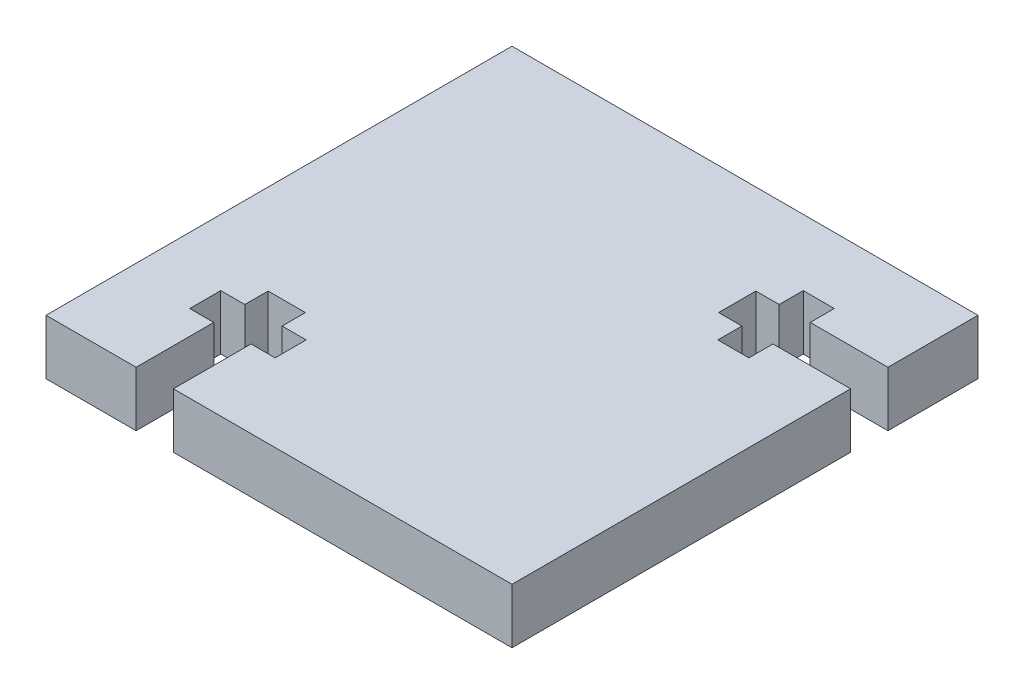
ISO-10303-21;
HEADER;
FILE_DESCRIPTION(('STEP AP214'),'2;1');
FILE_NAME('part.step','',(''),(''),'','','');
FILE_SCHEMA(('AUTOMOTIVE_DESIGN { 1 0 10303 214 1 1 1 1 }'));
ENDSEC;
DATA;
#1=APPLICATION_CONTEXT('core data for automotive mechanical design processes');
#2=APPLICATION_PROTOCOL_DEFINITION('international standard','automotive_design',2000,#1);
#3=PRODUCT_CONTEXT('',#1,'mechanical');
#4=PRODUCT('Part','Part','',(#3));
#5=PRODUCT_RELATED_PRODUCT_CATEGORY('part','',(#4));
#6=PRODUCT_DEFINITION_FORMATION('','',#4);
#7=PRODUCT_DEFINITION_CONTEXT('part definition',#1,'design');
#8=PRODUCT_DEFINITION('design','',#6,#7);
#9=PRODUCT_DEFINITION_SHAPE('','',#8);
#10=(LENGTH_UNIT() NAMED_UNIT(*) SI_UNIT(.MILLI.,.METRE.));
#11=(NAMED_UNIT(*) PLANE_ANGLE_UNIT() SI_UNIT($,.RADIAN.));
#12=(NAMED_UNIT(*) SI_UNIT($,.STERADIAN.) SOLID_ANGLE_UNIT());
#13=UNCERTAINTY_MEASURE_WITH_UNIT(LENGTH_MEASURE(1.E-05),#10,'distance_accuracy_value','');
#14=(GEOMETRIC_REPRESENTATION_CONTEXT(3) GLOBAL_UNCERTAINTY_ASSIGNED_CONTEXT((#13)) GLOBAL_UNIT_ASSIGNED_CONTEXT((#10,
#11,#12)) REPRESENTATION_CONTEXT('',''));
#15=CARTESIAN_POINT('',(0.,0.,0.));
#16=DIRECTION('',(0.,0.,1.));
#17=DIRECTION('',(1.,0.,0.));
#18=AXIS2_PLACEMENT_3D('',#15,#16,#17);
#19=CARTESIAN_POINT('',(-38.1,4.4958,-38.1));
#20=DIRECTION('',(1.,0.,0.));
#21=DIRECTION('',(0.,0.,-1.));
#22=AXIS2_PLACEMENT_3D('',#19,#20,#21);
#23=PLANE('',#22);
#24=DIRECTION('',(0.,0.,1.));
#25=VECTOR('',#24,1.);
#26=CARTESIAN_POINT('',(-38.1,0.,-38.1));
#27=LINE('',#26,#25);
#28=CARTESIAN_POINT('',(-38.1,0.,-38.1));
#29=VERTEX_POINT('',#28);
#30=CARTESIAN_POINT('',(-38.1,0.,0.));
#31=VERTEX_POINT('',#30);
#32=EDGE_CURVE('E251',#29,#31,#27,.T.);
#33=ORIENTED_EDGE('',*,*,#32,.T.);
#34=DIRECTION('',(0.,-1.,0.));
#35=VECTOR('',#34,1.);
#36=CARTESIAN_POINT('',(-38.1,4.4958,0.));
#37=LINE('',#36,#35);
#38=CARTESIAN_POINT('',(-38.1,4.4958,0.));
#39=VERTEX_POINT('',#38);
#40=EDGE_CURVE('E11',#39,#31,#37,.T.);
#41=ORIENTED_EDGE('',*,*,#40,.F.);
#42=DIRECTION('',(0.,0.,1.));
#43=VECTOR('',#42,1.);
#44=CARTESIAN_POINT('',(-38.1,4.4958,-38.1));
#45=LINE('',#44,#43);
#46=CARTESIAN_POINT('',(-38.1,4.4958,-38.1));
#47=VERTEX_POINT('',#46);
#48=EDGE_CURVE('E305',#47,#39,#45,.T.);
#49=ORIENTED_EDGE('',*,*,#48,.F.);
#50=DIRECTION('',(0.,-1.,0.));
#51=VECTOR('',#50,1.);
#52=CARTESIAN_POINT('',(-38.1,4.4958,-38.1));
#53=LINE('',#52,#51);
#54=EDGE_CURVE('E247',#47,#29,#53,.T.);
#55=ORIENTED_EDGE('',*,*,#54,.T.);
#56=EDGE_LOOP('',(#33,#41,#49,#55));
#57=FACE_BOUND('',#56,.T.);
#58=ADVANCED_FACE('F35',(#57),#23,.F.);
#59=CARTESIAN_POINT('',(-38.1,4.4958,0.));
#60=DIRECTION('',(0.,0.,-1.));
#61=DIRECTION('',(-1.,0.,0.));
#62=AXIS2_PLACEMENT_3D('',#59,#60,#61);
#63=PLANE('',#62);
#64=DIRECTION('',(1.,0.,0.));
#65=VECTOR('',#64,1.);
#66=CARTESIAN_POINT('',(-38.1,0.,0.));
#67=LINE('',#66,#65);
#68=CARTESIAN_POINT('',(-30.734,0.,0.));
#69=VERTEX_POINT('',#68);
#70=EDGE_CURVE('E254',#31,#69,#67,.T.);
#71=ORIENTED_EDGE('',*,*,#70,.T.);
#72=DIRECTION('',(0.,-1.,0.));
#73=VECTOR('',#72,1.);
#74=CARTESIAN_POINT('',(-30.734,4.4958,0.));
#75=LINE('',#74,#73);
#76=CARTESIAN_POINT('',(-30.734,4.4958,0.));
#77=VERTEX_POINT('',#76);
#78=EDGE_CURVE('E43',#77,#69,#75,.T.);
#79=ORIENTED_EDGE('',*,*,#78,.F.);
#80=DIRECTION('',(1.,0.,0.));
#81=VECTOR('',#80,1.);
#82=CARTESIAN_POINT('',(-38.1,4.4958,0.));
#83=LINE('',#82,#81);
#84=EDGE_CURVE('E154',#39,#77,#83,.T.);
#85=ORIENTED_EDGE('',*,*,#84,.F.);
#86=ORIENTED_EDGE('',*,*,#40,.T.);
#87=EDGE_LOOP('',(#71,#79,#85,#86));
#88=FACE_BOUND('',#87,.T.);
#89=ADVANCED_FACE('F463',(#88),#63,.F.);
#90=CARTESIAN_POINT('',(-30.734,4.4958,0.));
#91=DIRECTION('',(-1.,0.,0.));
#92=DIRECTION('',(0.,0.,1.));
#93=AXIS2_PLACEMENT_3D('',#90,#91,#92);
#94=PLANE('',#93);
#95=DIRECTION('',(0.,0.,-1.));
#96=VECTOR('',#95,1.);
#97=CARTESIAN_POINT('',(-30.734,0.,0.));
#98=LINE('',#97,#96);
#99=CARTESIAN_POINT('',(-30.734,0.,-6.35));
#100=VERTEX_POINT('',#99);
#101=EDGE_CURVE('E256',#69,#100,#98,.T.);
#102=ORIENTED_EDGE('',*,*,#101,.T.);
#103=DIRECTION('',(0.,-1.,0.));
#104=VECTOR('',#103,1.);
#105=CARTESIAN_POINT('',(-30.734,4.4958,-6.35));
#106=LINE('',#105,#104);
#107=CARTESIAN_POINT('',(-30.734,4.4958,-6.35));
#108=VERTEX_POINT('',#107);
#109=EDGE_CURVE('E372',#108,#100,#106,.T.);
#110=ORIENTED_EDGE('',*,*,#109,.F.);
#111=DIRECTION('',(0.,0.,-1.));
#112=VECTOR('',#111,1.);
#113=CARTESIAN_POINT('',(-30.734,4.4958,0.));
#114=LINE('',#113,#112);
#115=EDGE_CURVE('E380',#77,#108,#114,.T.);
#116=ORIENTED_EDGE('',*,*,#115,.F.);
#117=ORIENTED_EDGE('',*,*,#78,.T.);
#118=EDGE_LOOP('',(#102,#110,#116,#117));
#119=FACE_BOUND('',#118,.T.);
#120=ADVANCED_FACE('F378',(#119),#94,.F.);
#121=CARTESIAN_POINT('',(-30.734,4.4958,-6.35));
#122=DIRECTION('',(0.,0.,1.));
#123=DIRECTION('',(1.,0.,0.));
#124=AXIS2_PLACEMENT_3D('',#121,#122,#123);
#125=PLANE('',#124);
#126=DIRECTION('',(-1.,0.,0.));
#127=VECTOR('',#126,1.);
#128=CARTESIAN_POINT('',(-30.734,0.,-6.35));
#129=LINE('',#128,#127);
#130=CARTESIAN_POINT('',(-32.7025,0.,-6.35));
#131=VERTEX_POINT('',#130);
#132=EDGE_CURVE('E258',#100,#131,#129,.T.);
#133=ORIENTED_EDGE('',*,*,#132,.T.);
#134=DIRECTION('',(0.,-1.,0.));
#135=VECTOR('',#134,1.);
#136=CARTESIAN_POINT('',(-32.7025,4.4958,-6.35));
#137=LINE('',#136,#135);
#138=CARTESIAN_POINT('',(-32.7025,4.4958,-6.35));
#139=VERTEX_POINT('',#138);
#140=EDGE_CURVE('E369',#139,#131,#137,.T.);
#141=ORIENTED_EDGE('',*,*,#140,.F.);
#142=DIRECTION('',(-1.,0.,0.));
#143=VECTOR('',#142,1.);
#144=CARTESIAN_POINT('',(-30.734,4.4958,-6.35));
#145=LINE('',#144,#143);
#146=EDGE_CURVE('E398',#108,#139,#145,.T.);
#147=ORIENTED_EDGE('',*,*,#146,.F.);
#148=ORIENTED_EDGE('',*,*,#109,.T.);
#149=EDGE_LOOP('',(#133,#141,#147,#148));
#150=FACE_BOUND('',#149,.T.);
#151=ADVANCED_FACE('F389',(#150),#125,.F.);
#152=CARTESIAN_POINT('',(-32.7025,4.4958,-6.35));
#153=DIRECTION('',(-1.,0.,0.));
#154=DIRECTION('',(0.,0.,1.));
#155=AXIS2_PLACEMENT_3D('',#152,#153,#154);
#156=PLANE('',#155);
#157=DIRECTION('',(0.,0.,-1.));
#158=VECTOR('',#157,1.);
#159=CARTESIAN_POINT('',(-32.7025,0.,-6.35));
#160=LINE('',#159,#158);
#161=CARTESIAN_POINT('',(-32.7025,0.,-8.89));
#162=VERTEX_POINT('',#161);
#163=EDGE_CURVE('E260',#131,#162,#160,.T.);
#164=ORIENTED_EDGE('',*,*,#163,.T.);
#165=DIRECTION('',(0.,-1.,0.));
#166=VECTOR('',#165,1.);
#167=CARTESIAN_POINT('',(-32.7025,4.4958,-8.89));
#168=LINE('',#167,#166);
#169=CARTESIAN_POINT('',(-32.7025,4.4958,-8.89));
#170=VERTEX_POINT('',#169);
#171=EDGE_CURVE('E366',#170,#162,#168,.T.);
#172=ORIENTED_EDGE('',*,*,#171,.F.);
#173=DIRECTION('',(0.,0.,-1.));
#174=VECTOR('',#173,1.);
#175=CARTESIAN_POINT('',(-32.7025,4.4958,-6.35));
#176=LINE('',#175,#174);
#177=EDGE_CURVE('E395',#139,#170,#176,.T.);
#178=ORIENTED_EDGE('',*,*,#177,.F.);
#179=ORIENTED_EDGE('',*,*,#140,.T.);
#180=EDGE_LOOP('',(#164,#172,#178,#179));
#181=FACE_BOUND('',#180,.T.);
#182=ADVANCED_FACE('F393',(#181),#156,.F.);
#183=CARTESIAN_POINT('',(-32.7025,4.4958,-8.89));
#184=DIRECTION('',(0.,0.,-1.));
#185=DIRECTION('',(-1.,0.,0.));
#186=AXIS2_PLACEMENT_3D('',#183,#184,#185);
#187=PLANE('',#186);
#188=DIRECTION('',(1.,0.,0.));
#189=VECTOR('',#188,1.);
#190=CARTESIAN_POINT('',(-32.7025,0.,-8.89));
#191=LINE('',#190,#189);
#192=CARTESIAN_POINT('',(-30.734,0.,-8.89));
#193=VERTEX_POINT('',#192);
#194=EDGE_CURVE('E262',#162,#193,#191,.T.);
#195=ORIENTED_EDGE('',*,*,#194,.T.);
#196=DIRECTION('',(0.,-1.,0.));
#197=VECTOR('',#196,1.);
#198=CARTESIAN_POINT('',(-30.734,4.4958,-8.89));
#199=LINE('',#198,#197);
#200=CARTESIAN_POINT('',(-30.734,4.4958,-8.89));
#201=VERTEX_POINT('',#200);
#202=EDGE_CURVE('E363',#201,#193,#199,.T.);
#203=ORIENTED_EDGE('',*,*,#202,.F.);
#204=DIRECTION('',(1.,0.,0.));
#205=VECTOR('',#204,1.);
#206=CARTESIAN_POINT('',(-32.7025,4.4958,-8.89));
#207=LINE('',#206,#205);
#208=EDGE_CURVE('E397',#170,#201,#207,.T.);
#209=ORIENTED_EDGE('',*,*,#208,.F.);
#210=ORIENTED_EDGE('',*,*,#171,.T.);
#211=EDGE_LOOP('',(#195,#203,#209,#210));
#212=FACE_BOUND('',#211,.T.);
#213=ADVANCED_FACE('F476',(#212),#187,.F.);
#214=CARTESIAN_POINT('',(-30.734,4.4958,-8.89));
#215=DIRECTION('',(-1.,0.,0.));
#216=DIRECTION('',(0.,0.,1.));
#217=AXIS2_PLACEMENT_3D('',#214,#215,#216);
#218=PLANE('',#217);
#219=DIRECTION('',(0.,0.,-1.));
#220=VECTOR('',#219,1.);
#221=CARTESIAN_POINT('',(-30.734,0.,-8.89));
#222=LINE('',#221,#220);
#223=CARTESIAN_POINT('',(-30.734,0.,-10.795));
#224=VERTEX_POINT('',#223);
#225=EDGE_CURVE('E264',#193,#224,#222,.T.);
#226=ORIENTED_EDGE('',*,*,#225,.T.);
#227=DIRECTION('',(0.,-1.,0.));
#228=VECTOR('',#227,1.);
#229=CARTESIAN_POINT('',(-30.734,4.4958,-10.795));
#230=LINE('',#229,#228);
#231=CARTESIAN_POINT('',(-30.734,4.4958,-10.795));
#232=VERTEX_POINT('',#231);
#233=EDGE_CURVE('E360',#232,#224,#230,.T.);
#234=ORIENTED_EDGE('',*,*,#233,.F.);
#235=DIRECTION('',(0.,0.,-1.));
#236=VECTOR('',#235,1.);
#237=CARTESIAN_POINT('',(-30.734,4.4958,-8.89));
#238=LINE('',#237,#236);
#239=EDGE_CURVE('E400',#201,#232,#238,.T.);
#240=ORIENTED_EDGE('',*,*,#239,.F.);
#241=ORIENTED_EDGE('',*,*,#202,.T.);
#242=EDGE_LOOP('',(#226,#234,#240,#241));
#243=FACE_BOUND('',#242,.T.);
#244=ADVANCED_FACE('F479',(#243),#218,.F.);
#245=CARTESIAN_POINT('',(-30.734,4.4958,-10.795));
#246=DIRECTION('',(0.,0.,-1.));
#247=DIRECTION('',(-1.,0.,0.));
#248=AXIS2_PLACEMENT_3D('',#245,#246,#247);
#249=PLANE('',#248);
#250=DIRECTION('',(1.,0.,0.));
#251=VECTOR('',#250,1.);
#252=CARTESIAN_POINT('',(-30.734,0.,-10.795));
#253=LINE('',#252,#251);
#254=CARTESIAN_POINT('',(-27.686,0.,-10.795));
#255=VERTEX_POINT('',#254);
#256=EDGE_CURVE('E266',#224,#255,#253,.T.);
#257=ORIENTED_EDGE('',*,*,#256,.T.);
#258=DIRECTION('',(0.,-1.,0.));
#259=VECTOR('',#258,1.);
#260=CARTESIAN_POINT('',(-27.686,4.4958,-10.795));
#261=LINE('',#260,#259);
#262=CARTESIAN_POINT('',(-27.686,4.4958,-10.795));
#263=VERTEX_POINT('',#262);
#264=EDGE_CURVE('E357',#263,#255,#261,.T.);
#265=ORIENTED_EDGE('',*,*,#264,.F.);
#266=DIRECTION('',(1.,0.,0.));
#267=VECTOR('',#266,1.);
#268=CARTESIAN_POINT('',(-30.734,4.4958,-10.795));
#269=LINE('',#268,#267);
#270=EDGE_CURVE('E406',#232,#263,#269,.T.);
#271=ORIENTED_EDGE('',*,*,#270,.F.);
#272=ORIENTED_EDGE('',*,*,#233,.T.);
#273=EDGE_LOOP('',(#257,#265,#271,#272));
#274=FACE_BOUND('',#273,.T.);
#275=ADVANCED_FACE('F483',(#274),#249,.F.);
#276=CARTESIAN_POINT('',(-27.686,4.4958,-10.795));
#277=DIRECTION('',(1.,0.,0.));
#278=DIRECTION('',(0.,0.,-1.));
#279=AXIS2_PLACEMENT_3D('',#276,#277,#278);
#280=PLANE('',#279);
#281=DIRECTION('',(0.,0.,1.));
#282=VECTOR('',#281,1.);
#283=CARTESIAN_POINT('',(-27.686,0.,-10.795));
#284=LINE('',#283,#282);
#285=CARTESIAN_POINT('',(-27.686,0.,-8.89));
#286=VERTEX_POINT('',#285);
#287=EDGE_CURVE('E268',#255,#286,#284,.T.);
#288=ORIENTED_EDGE('',*,*,#287,.T.);
#289=DIRECTION('',(0.,-1.,0.));
#290=VECTOR('',#289,1.);
#291=CARTESIAN_POINT('',(-27.686,4.4958,-8.89));
#292=LINE('',#291,#290);
#293=CARTESIAN_POINT('',(-27.686,4.4958,-8.89));
#294=VERTEX_POINT('',#293);
#295=EDGE_CURVE('E354',#294,#286,#292,.T.);
#296=ORIENTED_EDGE('',*,*,#295,.F.);
#297=DIRECTION('',(0.,0.,1.));
#298=VECTOR('',#297,1.);
#299=CARTESIAN_POINT('',(-27.686,4.4958,-10.795));
#300=LINE('',#299,#298);
#301=EDGE_CURVE('E408',#263,#294,#300,.T.);
#302=ORIENTED_EDGE('',*,*,#301,.F.);
#303=ORIENTED_EDGE('',*,*,#264,.T.);
#304=EDGE_LOOP('',(#288,#296,#302,#303));
#305=FACE_BOUND('',#304,.T.);
#306=ADVANCED_FACE('F487',(#305),#280,.F.);
#307=CARTESIAN_POINT('',(-27.686,4.4958,-8.89));
#308=DIRECTION('',(0.,0.,-1.));
#309=DIRECTION('',(-1.,0.,0.));
#310=AXIS2_PLACEMENT_3D('',#307,#308,#309);
#311=PLANE('',#310);
#312=DIRECTION('',(1.,0.,0.));
#313=VECTOR('',#312,1.);
#314=CARTESIAN_POINT('',(-27.686,0.,-8.89));
#315=LINE('',#314,#313);
#316=CARTESIAN_POINT('',(-25.7175,0.,-8.89));
#317=VERTEX_POINT('',#316);
#318=EDGE_CURVE('E270',#286,#317,#315,.T.);
#319=ORIENTED_EDGE('',*,*,#318,.T.);
#320=DIRECTION('',(0.,-1.,0.));
#321=VECTOR('',#320,1.);
#322=CARTESIAN_POINT('',(-25.7175,4.4958,-8.89));
#323=LINE('',#322,#321);
#324=CARTESIAN_POINT('',(-25.7175,4.4958,-8.89));
#325=VERTEX_POINT('',#324);
#326=EDGE_CURVE('E351',#325,#317,#323,.T.);
#327=ORIENTED_EDGE('',*,*,#326,.F.);
#328=DIRECTION('',(1.,0.,0.));
#329=VECTOR('',#328,1.);
#330=CARTESIAN_POINT('',(-27.686,4.4958,-8.89));
#331=LINE('',#330,#329);
#332=EDGE_CURVE('E410',#294,#325,#331,.T.);
#333=ORIENTED_EDGE('',*,*,#332,.F.);
#334=ORIENTED_EDGE('',*,*,#295,.T.);
#335=EDGE_LOOP('',(#319,#327,#333,#334));
#336=FACE_BOUND('',#335,.T.);
#337=ADVANCED_FACE('F491',(#336),#311,.F.);
#338=CARTESIAN_POINT('',(-25.7175,4.4958,-8.89));
#339=DIRECTION('',(1.,0.,0.));
#340=DIRECTION('',(0.,0.,-1.));
#341=AXIS2_PLACEMENT_3D('',#338,#339,#340);
#342=PLANE('',#341);
#343=DIRECTION('',(0.,0.,1.));
#344=VECTOR('',#343,1.);
#345=CARTESIAN_POINT('',(-25.7175,0.,-8.89));
#346=LINE('',#345,#344);
#347=CARTESIAN_POINT('',(-25.7175,0.,-6.35));
#348=VERTEX_POINT('',#347);
#349=EDGE_CURVE('E272',#317,#348,#346,.T.);
#350=ORIENTED_EDGE('',*,*,#349,.T.);
#351=DIRECTION('',(0.,-1.,0.));
#352=VECTOR('',#351,1.);
#353=CARTESIAN_POINT('',(-25.7175,4.4958,-6.35));
#354=LINE('',#353,#352);
#355=CARTESIAN_POINT('',(-25.7175,4.4958,-6.35));
#356=VERTEX_POINT('',#355);
#357=EDGE_CURVE('E348',#356,#348,#354,.T.);
#358=ORIENTED_EDGE('',*,*,#357,.F.);
#359=DIRECTION('',(0.,0.,1.));
#360=VECTOR('',#359,1.);
#361=CARTESIAN_POINT('',(-25.7175,4.4958,-8.89));
#362=LINE('',#361,#360);
#363=EDGE_CURVE('E412',#325,#356,#362,.T.);
#364=ORIENTED_EDGE('',*,*,#363,.F.);
#365=ORIENTED_EDGE('',*,*,#326,.T.);
#366=EDGE_LOOP('',(#350,#358,#364,#365));
#367=FACE_BOUND('',#366,.T.);
#368=ADVANCED_FACE('F495',(#367),#342,.F.);
#369=CARTESIAN_POINT('',(-25.7175,4.4958,-6.35));
#370=DIRECTION('',(0.,0.,1.));
#371=DIRECTION('',(1.,0.,0.));
#372=AXIS2_PLACEMENT_3D('',#369,#370,#371);
#373=PLANE('',#372);
#374=DIRECTION('',(-1.,0.,0.));
#375=VECTOR('',#374,1.);
#376=CARTESIAN_POINT('',(-25.7175,0.,-6.35));
#377=LINE('',#376,#375);
#378=CARTESIAN_POINT('',(-27.686,0.,-6.35));
#379=VERTEX_POINT('',#378);
#380=EDGE_CURVE('E274',#348,#379,#377,.T.);
#381=ORIENTED_EDGE('',*,*,#380,.T.);
#382=DIRECTION('',(0.,-1.,0.));
#383=VECTOR('',#382,1.);
#384=CARTESIAN_POINT('',(-27.686,4.4958,-6.35));
#385=LINE('',#384,#383);
#386=CARTESIAN_POINT('',(-27.686,4.4958,-6.35));
#387=VERTEX_POINT('',#386);
#388=EDGE_CURVE('E345',#387,#379,#385,.T.);
#389=ORIENTED_EDGE('',*,*,#388,.F.);
#390=DIRECTION('',(-1.,0.,0.));
#391=VECTOR('',#390,1.);
#392=CARTESIAN_POINT('',(-25.7175,4.4958,-6.35));
#393=LINE('',#392,#391);
#394=EDGE_CURVE('E414',#356,#387,#393,.T.);
#395=ORIENTED_EDGE('',*,*,#394,.F.);
#396=ORIENTED_EDGE('',*,*,#357,.T.);
#397=EDGE_LOOP('',(#381,#389,#395,#396));
#398=FACE_BOUND('',#397,.T.);
#399=ADVANCED_FACE('F499',(#398),#373,.F.);
#400=CARTESIAN_POINT('',(-27.686,4.4958,-6.35));
#401=DIRECTION('',(1.,0.,0.));
#402=DIRECTION('',(0.,0.,-1.));
#403=AXIS2_PLACEMENT_3D('',#400,#401,#402);
#404=PLANE('',#403);
#405=DIRECTION('',(0.,0.,1.));
#406=VECTOR('',#405,1.);
#407=CARTESIAN_POINT('',(-27.686,0.,-6.35));
#408=LINE('',#407,#406);
#409=CARTESIAN_POINT('',(-27.686,0.,0.));
#410=VERTEX_POINT('',#409);
#411=EDGE_CURVE('E276',#379,#410,#408,.T.);
#412=ORIENTED_EDGE('',*,*,#411,.T.);
#413=DIRECTION('',(0.,-1.,0.));
#414=VECTOR('',#413,1.);
#415=CARTESIAN_POINT('',(-27.686,4.4958,0.));
#416=LINE('',#415,#414);
#417=CARTESIAN_POINT('',(-27.686,4.4958,0.));
#418=VERTEX_POINT('',#417);
#419=EDGE_CURVE('E342',#418,#410,#416,.T.);
#420=ORIENTED_EDGE('',*,*,#419,.F.);
#421=DIRECTION('',(0.,0.,1.));
#422=VECTOR('',#421,1.);
#423=CARTESIAN_POINT('',(-27.686,4.4958,-6.35));
#424=LINE('',#423,#422);
#425=EDGE_CURVE('E416',#387,#418,#424,.T.);
#426=ORIENTED_EDGE('',*,*,#425,.F.);
#427=ORIENTED_EDGE('',*,*,#388,.T.);
#428=EDGE_LOOP('',(#412,#420,#426,#427));
#429=FACE_BOUND('',#428,.T.);
#430=ADVANCED_FACE('F503',(#429),#404,.F.);
#431=CARTESIAN_POINT('',(-27.686,4.4958,0.));
#432=DIRECTION('',(0.,0.,-1.));
#433=DIRECTION('',(-1.,0.,0.));
#434=AXIS2_PLACEMENT_3D('',#431,#432,#433);
#435=PLANE('',#434);
#436=DIRECTION('',(1.,0.,0.));
#437=VECTOR('',#436,1.);
#438=CARTESIAN_POINT('',(-27.686,0.,0.));
#439=LINE('',#438,#437);
#440=CARTESIAN_POINT('',(0.,0.,0.));
#441=VERTEX_POINT('',#440);
#442=EDGE_CURVE('E278',#410,#441,#439,.T.);
#443=ORIENTED_EDGE('',*,*,#442,.T.);
#444=DIRECTION('',(0.,-1.,0.));
#445=VECTOR('',#444,1.);
#446=CARTESIAN_POINT('',(0.,4.4958,0.));
#447=LINE('',#446,#445);
#448=CARTESIAN_POINT('',(0.,4.4958,0.));
#449=VERTEX_POINT('',#448);
#450=EDGE_CURVE('E339',#449,#441,#447,.T.);
#451=ORIENTED_EDGE('',*,*,#450,.F.);
#452=DIRECTION('',(1.,0.,0.));
#453=VECTOR('',#452,1.);
#454=CARTESIAN_POINT('',(-27.686,4.4958,0.));
#455=LINE('',#454,#453);
#456=EDGE_CURVE('E418',#418,#449,#455,.T.);
#457=ORIENTED_EDGE('',*,*,#456,.F.);
#458=ORIENTED_EDGE('',*,*,#419,.T.);
#459=EDGE_LOOP('',(#443,#451,#457,#458));
#460=FACE_BOUND('',#459,.T.);
#461=ADVANCED_FACE('F507',(#460),#435,.F.);
#462=CARTESIAN_POINT('',(0.,4.4958,-27.686));
#463=DIRECTION('',(-1.,0.,0.));
#464=DIRECTION('',(0.,0.,1.));
#465=AXIS2_PLACEMENT_3D('',#462,#463,#464);
#466=PLANE('',#465);
#467=DIRECTION('',(0.,0.,-1.));
#468=VECTOR('',#467,1.);
#469=CARTESIAN_POINT('',(0.,0.,-27.686));
#470=LINE('',#469,#468);
#471=CARTESIAN_POINT('',(0.,0.,-27.686));
#472=VERTEX_POINT('',#471);
#473=EDGE_CURVE('E280',#441,#472,#470,.T.);
#474=ORIENTED_EDGE('',*,*,#473,.T.);
#475=DIRECTION('',(0.,-1.,0.));
#476=VECTOR('',#475,1.);
#477=CARTESIAN_POINT('',(0.,4.4958,-27.686));
#478=LINE('',#477,#476);
#479=CARTESIAN_POINT('',(0.,4.4958,-27.686));
#480=VERTEX_POINT('',#479);
#481=EDGE_CURVE('E336',#480,#472,#478,.T.);
#482=ORIENTED_EDGE('',*,*,#481,.F.);
#483=DIRECTION('',(0.,0.,-1.));
#484=VECTOR('',#483,1.);
#485=CARTESIAN_POINT('',(0.,4.4958,-27.686));
#486=LINE('',#485,#484);
#487=EDGE_CURVE('E420',#449,#480,#486,.T.);
#488=ORIENTED_EDGE('',*,*,#487,.F.);
#489=ORIENTED_EDGE('',*,*,#450,.T.);
#490=EDGE_LOOP('',(#474,#482,#488,#489));
#491=FACE_BOUND('',#490,.T.);
#492=ADVANCED_FACE('F511',(#491),#466,.F.);
#493=CARTESIAN_POINT('',(0.,4.4958,-27.686));
#494=DIRECTION('',(0.,0.,1.));
#495=DIRECTION('',(1.,0.,0.));
#496=AXIS2_PLACEMENT_3D('',#493,#494,#495);
#497=PLANE('',#496);
#498=DIRECTION('',(-1.,0.,0.));
#499=VECTOR('',#498,1.);
#500=CARTESIAN_POINT('',(0.,0.,-27.686));
#501=LINE('',#500,#499);
#502=CARTESIAN_POINT('',(-6.35,0.,-27.686));
#503=VERTEX_POINT('',#502);
#504=EDGE_CURVE('E282',#472,#503,#501,.T.);
#505=ORIENTED_EDGE('',*,*,#504,.T.);
#506=DIRECTION('',(0.,-1.,0.));
#507=VECTOR('',#506,1.);
#508=CARTESIAN_POINT('',(-6.35,4.4958,-27.686));
#509=LINE('',#508,#507);
#510=CARTESIAN_POINT('',(-6.35,4.4958,-27.686));
#511=VERTEX_POINT('',#510);
#512=EDGE_CURVE('E333',#511,#503,#509,.T.);
#513=ORIENTED_EDGE('',*,*,#512,.F.);
#514=DIRECTION('',(-1.,0.,0.));
#515=VECTOR('',#514,1.);
#516=CARTESIAN_POINT('',(0.,4.4958,-27.686));
#517=LINE('',#516,#515);
#518=EDGE_CURVE('E422',#480,#511,#517,.T.);
#519=ORIENTED_EDGE('',*,*,#518,.F.);
#520=ORIENTED_EDGE('',*,*,#481,.T.);
#521=EDGE_LOOP('',(#505,#513,#519,#520));
#522=FACE_BOUND('',#521,.T.);
#523=ADVANCED_FACE('F515',(#522),#497,.F.);
#524=CARTESIAN_POINT('',(-6.35,4.4958,-27.686));
#525=DIRECTION('',(1.,0.,0.));
#526=DIRECTION('',(0.,0.,-1.));
#527=AXIS2_PLACEMENT_3D('',#524,#525,#526);
#528=PLANE('',#527);
#529=DIRECTION('',(0.,0.,1.));
#530=VECTOR('',#529,1.);
#531=CARTESIAN_POINT('',(-6.35,0.,-27.686));
#532=LINE('',#531,#530);
#533=CARTESIAN_POINT('',(-6.35,0.,-25.7175000000001));
#534=VERTEX_POINT('',#533);
#535=EDGE_CURVE('E284',#503,#534,#532,.T.);
#536=ORIENTED_EDGE('',*,*,#535,.T.);
#537=DIRECTION('',(0.,-1.,0.));
#538=VECTOR('',#537,1.);
#539=CARTESIAN_POINT('',(-6.35,4.4958,-25.7175000000001));
#540=LINE('',#539,#538);
#541=CARTESIAN_POINT('',(-6.35,4.4958,-25.7175000000001));
#542=VERTEX_POINT('',#541);
#543=EDGE_CURVE('E330',#542,#534,#540,.T.);
#544=ORIENTED_EDGE('',*,*,#543,.F.);
#545=DIRECTION('',(0.,0.,1.));
#546=VECTOR('',#545,1.);
#547=CARTESIAN_POINT('',(-6.35,4.4958,-27.686));
#548=LINE('',#547,#546);
#549=EDGE_CURVE('E424',#511,#542,#548,.T.);
#550=ORIENTED_EDGE('',*,*,#549,.F.);
#551=ORIENTED_EDGE('',*,*,#512,.T.);
#552=EDGE_LOOP('',(#536,#544,#550,#551));
#553=FACE_BOUND('',#552,.T.);
#554=ADVANCED_FACE('F519',(#553),#528,.F.);
#555=CARTESIAN_POINT('',(-6.35,4.4958,-25.7175000000001));
#556=DIRECTION('',(0.,0.,1.));
#557=DIRECTION('',(1.,0.,0.));
#558=AXIS2_PLACEMENT_3D('',#555,#556,#557);
#559=PLANE('',#558);
#560=DIRECTION('',(-1.,0.,0.));
#561=VECTOR('',#560,1.);
#562=CARTESIAN_POINT('',(-6.35,0.,-25.7175000000001));
#563=LINE('',#562,#561);
#564=CARTESIAN_POINT('',(-8.89,0.,-25.7175000000001));
#565=VERTEX_POINT('',#564);
#566=EDGE_CURVE('E286',#534,#565,#563,.T.);
#567=ORIENTED_EDGE('',*,*,#566,.T.);
#568=DIRECTION('',(0.,-1.,0.));
#569=VECTOR('',#568,1.);
#570=CARTESIAN_POINT('',(-8.89,4.4958,-25.7175000000001));
#571=LINE('',#570,#569);
#572=CARTESIAN_POINT('',(-8.89,4.4958,-25.7175000000001));
#573=VERTEX_POINT('',#572);
#574=EDGE_CURVE('E327',#573,#565,#571,.T.);
#575=ORIENTED_EDGE('',*,*,#574,.F.);
#576=DIRECTION('',(-1.,0.,0.));
#577=VECTOR('',#576,1.);
#578=CARTESIAN_POINT('',(-6.35,4.4958,-25.7175000000001));
#579=LINE('',#578,#577);
#580=EDGE_CURVE('E426',#542,#573,#579,.T.);
#581=ORIENTED_EDGE('',*,*,#580,.F.);
#582=ORIENTED_EDGE('',*,*,#543,.T.);
#583=EDGE_LOOP('',(#567,#575,#581,#582));
#584=FACE_BOUND('',#583,.T.);
#585=ADVANCED_FACE('F523',(#584),#559,.F.);
#586=CARTESIAN_POINT('',(-8.89,4.4958,-25.7175000000001));
#587=DIRECTION('',(-1.,0.,0.));
#588=DIRECTION('',(0.,0.,1.));
#589=AXIS2_PLACEMENT_3D('',#586,#587,#588);
#590=PLANE('',#589);
#591=DIRECTION('',(0.,0.,-1.));
#592=VECTOR('',#591,1.);
#593=CARTESIAN_POINT('',(-8.89,0.,-25.7175000000001));
#594=LINE('',#593,#592);
#595=CARTESIAN_POINT('',(-8.89,0.,-27.686));
#596=VERTEX_POINT('',#595);
#597=EDGE_CURVE('E288',#565,#596,#594,.T.);
#598=ORIENTED_EDGE('',*,*,#597,.T.);
#599=DIRECTION('',(0.,-1.,0.));
#600=VECTOR('',#599,1.);
#601=CARTESIAN_POINT('',(-8.89,4.4958,-27.686));
#602=LINE('',#601,#600);
#603=CARTESIAN_POINT('',(-8.89,4.4958,-27.686));
#604=VERTEX_POINT('',#603);
#605=EDGE_CURVE('E324',#604,#596,#602,.T.);
#606=ORIENTED_EDGE('',*,*,#605,.F.);
#607=DIRECTION('',(0.,0.,-1.));
#608=VECTOR('',#607,1.);
#609=CARTESIAN_POINT('',(-8.89,4.4958,-25.7175000000001));
#610=LINE('',#609,#608);
#611=EDGE_CURVE('E428',#573,#604,#610,.T.);
#612=ORIENTED_EDGE('',*,*,#611,.F.);
#613=ORIENTED_EDGE('',*,*,#574,.T.);
#614=EDGE_LOOP('',(#598,#606,#612,#613));
#615=FACE_BOUND('',#614,.T.);
#616=ADVANCED_FACE('F527',(#615),#590,.F.);
#617=CARTESIAN_POINT('',(-8.89,4.4958,-27.686));
#618=DIRECTION('',(0.,0.,1.));
#619=DIRECTION('',(1.,0.,0.));
#620=AXIS2_PLACEMENT_3D('',#617,#618,#619);
#621=PLANE('',#620);
#622=DIRECTION('',(-1.,0.,0.));
#623=VECTOR('',#622,1.);
#624=CARTESIAN_POINT('',(-8.89,0.,-27.686));
#625=LINE('',#624,#623);
#626=CARTESIAN_POINT('',(-10.795,0.,-27.686));
#627=VERTEX_POINT('',#626);
#628=EDGE_CURVE('E290',#596,#627,#625,.T.);
#629=ORIENTED_EDGE('',*,*,#628,.T.);
#630=DIRECTION('',(0.,-1.,0.));
#631=VECTOR('',#630,1.);
#632=CARTESIAN_POINT('',(-10.795,4.4958,-27.686));
#633=LINE('',#632,#631);
#634=CARTESIAN_POINT('',(-10.795,4.4958,-27.686));
#635=VERTEX_POINT('',#634);
#636=EDGE_CURVE('E321',#635,#627,#633,.T.);
#637=ORIENTED_EDGE('',*,*,#636,.F.);
#638=DIRECTION('',(-1.,0.,0.));
#639=VECTOR('',#638,1.);
#640=CARTESIAN_POINT('',(-8.89,4.4958,-27.686));
#641=LINE('',#640,#639);
#642=EDGE_CURVE('E430',#604,#635,#641,.T.);
#643=ORIENTED_EDGE('',*,*,#642,.F.);
#644=ORIENTED_EDGE('',*,*,#605,.T.);
#645=EDGE_LOOP('',(#629,#637,#643,#644));
#646=FACE_BOUND('',#645,.T.);
#647=ADVANCED_FACE('F531',(#646),#621,.F.);
#648=CARTESIAN_POINT('',(-10.795,4.4958,-27.686));
#649=DIRECTION('',(-1.,0.,0.));
#650=DIRECTION('',(0.,0.,1.));
#651=AXIS2_PLACEMENT_3D('',#648,#649,#650);
#652=PLANE('',#651);
#653=DIRECTION('',(0.,0.,-1.));
#654=VECTOR('',#653,1.);
#655=CARTESIAN_POINT('',(-10.795,0.,-27.686));
#656=LINE('',#655,#654);
#657=CARTESIAN_POINT('',(-10.795,0.,-30.734));
#658=VERTEX_POINT('',#657);
#659=EDGE_CURVE('E292',#627,#658,#656,.T.);
#660=ORIENTED_EDGE('',*,*,#659,.T.);
#661=DIRECTION('',(0.,-1.,0.));
#662=VECTOR('',#661,1.);
#663=CARTESIAN_POINT('',(-10.795,4.4958,-30.734));
#664=LINE('',#663,#662);
#665=CARTESIAN_POINT('',(-10.795,4.4958,-30.734));
#666=VERTEX_POINT('',#665);
#667=EDGE_CURVE('E318',#666,#658,#664,.T.);
#668=ORIENTED_EDGE('',*,*,#667,.F.);
#669=DIRECTION('',(0.,0.,-1.));
#670=VECTOR('',#669,1.);
#671=CARTESIAN_POINT('',(-10.795,4.4958,-27.686));
#672=LINE('',#671,#670);
#673=EDGE_CURVE('E432',#635,#666,#672,.T.);
#674=ORIENTED_EDGE('',*,*,#673,.F.);
#675=ORIENTED_EDGE('',*,*,#636,.T.);
#676=EDGE_LOOP('',(#660,#668,#674,#675));
#677=FACE_BOUND('',#676,.T.);
#678=ADVANCED_FACE('F535',(#677),#652,.F.);
#679=CARTESIAN_POINT('',(-10.795,4.4958,-30.734));
#680=DIRECTION('',(0.,0.,-1.));
#681=DIRECTION('',(-1.,0.,0.));
#682=AXIS2_PLACEMENT_3D('',#679,#680,#681);
#683=PLANE('',#682);
#684=DIRECTION('',(1.,0.,0.));
#685=VECTOR('',#684,1.);
#686=CARTESIAN_POINT('',(-10.795,0.,-30.734));
#687=LINE('',#686,#685);
#688=CARTESIAN_POINT('',(-8.89,0.,-30.734));
#689=VERTEX_POINT('',#688);
#690=EDGE_CURVE('E294',#658,#689,#687,.T.);
#691=ORIENTED_EDGE('',*,*,#690,.T.);
#692=DIRECTION('',(0.,-1.,0.));
#693=VECTOR('',#692,1.);
#694=CARTESIAN_POINT('',(-8.89,4.4958,-30.734));
#695=LINE('',#694,#693);
#696=CARTESIAN_POINT('',(-8.89,4.4958,-30.734));
#697=VERTEX_POINT('',#696);
#698=EDGE_CURVE('E315',#697,#689,#695,.T.);
#699=ORIENTED_EDGE('',*,*,#698,.F.);
#700=DIRECTION('',(1.,0.,0.));
#701=VECTOR('',#700,1.);
#702=CARTESIAN_POINT('',(-10.795,4.4958,-30.734));
#703=LINE('',#702,#701);
#704=EDGE_CURVE('E434',#666,#697,#703,.T.);
#705=ORIENTED_EDGE('',*,*,#704,.F.);
#706=ORIENTED_EDGE('',*,*,#667,.T.);
#707=EDGE_LOOP('',(#691,#699,#705,#706));
#708=FACE_BOUND('',#707,.T.);
#709=ADVANCED_FACE('F539',(#708),#683,.F.);
#710=CARTESIAN_POINT('',(-8.89,4.4958,-30.734));
#711=DIRECTION('',(-1.,0.,0.));
#712=DIRECTION('',(0.,0.,1.));
#713=AXIS2_PLACEMENT_3D('',#710,#711,#712);
#714=PLANE('',#713);
#715=DIRECTION('',(0.,0.,-1.));
#716=VECTOR('',#715,1.);
#717=CARTESIAN_POINT('',(-8.89,0.,-30.734));
#718=LINE('',#717,#716);
#719=CARTESIAN_POINT('',(-8.89,0.,-32.7025000000001));
#720=VERTEX_POINT('',#719);
#721=EDGE_CURVE('E296',#689,#720,#718,.T.);
#722=ORIENTED_EDGE('',*,*,#721,.T.);
#723=DIRECTION('',(0.,-1.,0.));
#724=VECTOR('',#723,1.);
#725=CARTESIAN_POINT('',(-8.89,4.4958,-32.7025000000001));
#726=LINE('',#725,#724);
#727=CARTESIAN_POINT('',(-8.89,4.4958,-32.7025000000001));
#728=VERTEX_POINT('',#727);
#729=EDGE_CURVE('E312',#728,#720,#726,.T.);
#730=ORIENTED_EDGE('',*,*,#729,.F.);
#731=DIRECTION('',(0.,0.,-1.));
#732=VECTOR('',#731,1.);
#733=CARTESIAN_POINT('',(-8.89,4.4958,-30.734));
#734=LINE('',#733,#732);
#735=EDGE_CURVE('E436',#697,#728,#734,.T.);
#736=ORIENTED_EDGE('',*,*,#735,.F.);
#737=ORIENTED_EDGE('',*,*,#698,.T.);
#738=EDGE_LOOP('',(#722,#730,#736,#737));
#739=FACE_BOUND('',#738,.T.);
#740=ADVANCED_FACE('F543',(#739),#714,.F.);
#741=CARTESIAN_POINT('',(-8.89,4.4958,-32.7025000000001));
#742=DIRECTION('',(0.,0.,-1.));
#743=DIRECTION('',(-1.,0.,0.));
#744=AXIS2_PLACEMENT_3D('',#741,#742,#743);
#745=PLANE('',#744);
#746=DIRECTION('',(1.,0.,0.));
#747=VECTOR('',#746,1.);
#748=CARTESIAN_POINT('',(-8.89,0.,-32.7025000000001));
#749=LINE('',#748,#747);
#750=CARTESIAN_POINT('',(-6.35,0.,-32.7025000000001));
#751=VERTEX_POINT('',#750);
#752=EDGE_CURVE('E298',#720,#751,#749,.T.);
#753=ORIENTED_EDGE('',*,*,#752,.T.);
#754=DIRECTION('',(0.,-1.,0.));
#755=VECTOR('',#754,1.);
#756=CARTESIAN_POINT('',(-6.35,4.4958,-32.7025000000001));
#757=LINE('',#756,#755);
#758=CARTESIAN_POINT('',(-6.35,4.4958,-32.7025000000001));
#759=VERTEX_POINT('',#758);
#760=EDGE_CURVE('E309',#759,#751,#757,.T.);
#761=ORIENTED_EDGE('',*,*,#760,.F.);
#762=DIRECTION('',(1.,0.,0.));
#763=VECTOR('',#762,1.);
#764=CARTESIAN_POINT('',(-8.89,4.4958,-32.7025000000001));
#765=LINE('',#764,#763);
#766=EDGE_CURVE('E438',#728,#759,#765,.T.);
#767=ORIENTED_EDGE('',*,*,#766,.F.);
#768=ORIENTED_EDGE('',*,*,#729,.T.);
#769=EDGE_LOOP('',(#753,#761,#767,#768));
#770=FACE_BOUND('',#769,.T.);
#771=ADVANCED_FACE('F444',(#770),#745,.F.);
#772=CARTESIAN_POINT('',(-6.35,4.4958,-32.7025000000001));
#773=DIRECTION('',(1.,0.,0.));
#774=DIRECTION('',(0.,0.,-1.));
#775=AXIS2_PLACEMENT_3D('',#772,#773,#774);
#776=PLANE('',#775);
#777=DIRECTION('',(0.,0.,1.));
#778=VECTOR('',#777,1.);
#779=CARTESIAN_POINT('',(-6.35,0.,-32.7025000000001));
#780=LINE('',#779,#778);
#781=CARTESIAN_POINT('',(-6.35,0.,-30.734));
#782=VERTEX_POINT('',#781);
#783=EDGE_CURVE('E300',#751,#782,#780,.T.);
#784=ORIENTED_EDGE('',*,*,#783,.T.);
#785=DIRECTION('',(0.,-1.,0.));
#786=VECTOR('',#785,1.);
#787=CARTESIAN_POINT('',(-6.35,4.4958,-30.734));
#788=LINE('',#787,#786);
#789=CARTESIAN_POINT('',(-6.35,4.4958,-30.734));
#790=VERTEX_POINT('',#789);
#791=EDGE_CURVE('E242',#790,#782,#788,.T.);
#792=ORIENTED_EDGE('',*,*,#791,.F.);
#793=DIRECTION('',(0.,0.,1.));
#794=VECTOR('',#793,1.);
#795=CARTESIAN_POINT('',(-6.35,4.4958,-32.7025000000001));
#796=LINE('',#795,#794);
#797=EDGE_CURVE('E233',#759,#790,#796,.T.);
#798=ORIENTED_EDGE('',*,*,#797,.F.);
#799=ORIENTED_EDGE('',*,*,#760,.T.);
#800=EDGE_LOOP('',(#784,#792,#798,#799));
#801=FACE_BOUND('',#800,.T.);
#802=ADVANCED_FACE('F448',(#801),#776,.F.);
#803=CARTESIAN_POINT('',(-6.35,4.4958,-30.734));
#804=DIRECTION('',(0.,0.,-1.));
#805=DIRECTION('',(-1.,0.,0.));
#806=AXIS2_PLACEMENT_3D('',#803,#804,#805);
#807=PLANE('',#806);
#808=DIRECTION('',(1.,0.,0.));
#809=VECTOR('',#808,1.);
#810=CARTESIAN_POINT('',(-6.35,0.,-30.734));
#811=LINE('',#810,#809);
#812=CARTESIAN_POINT('',(0.,0.,-30.734));
#813=VERTEX_POINT('',#812);
#814=EDGE_CURVE('E241',#782,#813,#811,.T.);
#815=ORIENTED_EDGE('',*,*,#814,.T.);
#816=DIRECTION('',(0.,-1.,0.));
#817=VECTOR('',#816,1.);
#818=CARTESIAN_POINT('',(0.,4.4958,-30.734));
#819=LINE('',#818,#817);
#820=CARTESIAN_POINT('',(0.,4.4958,-30.734));
#821=VERTEX_POINT('',#820);
#822=EDGE_CURVE('E238',#821,#813,#819,.T.);
#823=ORIENTED_EDGE('',*,*,#822,.F.);
#824=DIRECTION('',(1.,0.,0.));
#825=VECTOR('',#824,1.);
#826=CARTESIAN_POINT('',(-6.35,4.4958,-30.734));
#827=LINE('',#826,#825);
#828=EDGE_CURVE('E227',#790,#821,#827,.T.);
#829=ORIENTED_EDGE('',*,*,#828,.F.);
#830=ORIENTED_EDGE('',*,*,#791,.T.);
#831=EDGE_LOOP('',(#815,#823,#829,#830));
#832=FACE_BOUND('',#831,.T.);
#833=ADVANCED_FACE('F239',(#832),#807,.F.);
#834=CARTESIAN_POINT('',(0.,4.4958,-38.1));
#835=DIRECTION('',(-1.,0.,0.));
#836=DIRECTION('',(0.,0.,1.));
#837=AXIS2_PLACEMENT_3D('',#834,#835,#836);
#838=PLANE('',#837);
#839=DIRECTION('',(0.,0.,-1.));
#840=VECTOR('',#839,1.);
#841=CARTESIAN_POINT('',(0.,0.,-38.1));
#842=LINE('',#841,#840);
#843=CARTESIAN_POINT('',(0.,0.,-38.1));
#844=VERTEX_POINT('',#843);
#845=EDGE_CURVE('E140',#813,#844,#842,.T.);
#846=ORIENTED_EDGE('',*,*,#845,.T.);
#847=DIRECTION('',(0.,-1.,0.));
#848=VECTOR('',#847,1.);
#849=CARTESIAN_POINT('',(0.,4.4958,-38.1));
#850=LINE('',#849,#848);
#851=CARTESIAN_POINT('',(0.,4.4958,-38.1));
#852=VERTEX_POINT('',#851);
#853=EDGE_CURVE('E243',#852,#844,#850,.T.);
#854=ORIENTED_EDGE('',*,*,#853,.F.);
#855=DIRECTION('',(0.,0.,-1.));
#856=VECTOR('',#855,1.);
#857=CARTESIAN_POINT('',(0.,4.4958,-38.1));
#858=LINE('',#857,#856);
#859=EDGE_CURVE('E231',#821,#852,#858,.T.);
#860=ORIENTED_EDGE('',*,*,#859,.F.);
#861=ORIENTED_EDGE('',*,*,#822,.T.);
#862=EDGE_LOOP('',(#846,#854,#860,#861));
#863=FACE_BOUND('',#862,.T.);
#864=ADVANCED_FACE('F245',(#863),#838,.F.);
#865=CARTESIAN_POINT('',(-38.1,4.4958,-38.1));
#866=DIRECTION('',(0.,0.,1.));
#867=DIRECTION('',(1.,0.,0.));
#868=AXIS2_PLACEMENT_3D('',#865,#866,#867);
#869=PLANE('',#868);
#870=DIRECTION('',(-1.,0.,0.));
#871=VECTOR('',#870,1.);
#872=CARTESIAN_POINT('',(-38.1,0.,-38.1));
#873=LINE('',#872,#871);
#874=EDGE_CURVE('E146',#844,#29,#873,.T.);
#875=ORIENTED_EDGE('',*,*,#874,.T.);
#876=ORIENTED_EDGE('',*,*,#54,.F.);
#877=DIRECTION('',(-1.,0.,0.));
#878=VECTOR('',#877,1.);
#879=CARTESIAN_POINT('',(-38.1,4.4958,-38.1));
#880=LINE('',#879,#878);
#881=EDGE_CURVE('E51',#852,#47,#880,.T.);
#882=ORIENTED_EDGE('',*,*,#881,.F.);
#883=ORIENTED_EDGE('',*,*,#853,.T.);
#884=EDGE_LOOP('',(#875,#876,#882,#883));
#885=FACE_BOUND('',#884,.T.);
#886=ADVANCED_FACE('F452',(#885),#869,.F.);
#887=CARTESIAN_POINT('',(0.,4.4958,0.));
#888=DIRECTION('',(0.,1.,0.));
#889=DIRECTION('',(0.,0.,1.));
#890=AXIS2_PLACEMENT_3D('',#887,#888,#889);
#891=PLANE('',#890);
#892=ORIENTED_EDGE('',*,*,#48,.T.);
#893=ORIENTED_EDGE('',*,*,#84,.T.);
#894=ORIENTED_EDGE('',*,*,#115,.T.);
#895=ORIENTED_EDGE('',*,*,#146,.T.);
#896=ORIENTED_EDGE('',*,*,#177,.T.);
#897=ORIENTED_EDGE('',*,*,#208,.T.);
#898=ORIENTED_EDGE('',*,*,#239,.T.);
#899=ORIENTED_EDGE('',*,*,#270,.T.);
#900=ORIENTED_EDGE('',*,*,#301,.T.);
#901=ORIENTED_EDGE('',*,*,#332,.T.);
#902=ORIENTED_EDGE('',*,*,#363,.T.);
#903=ORIENTED_EDGE('',*,*,#394,.T.);
#904=ORIENTED_EDGE('',*,*,#425,.T.);
#905=ORIENTED_EDGE('',*,*,#456,.T.);
#906=ORIENTED_EDGE('',*,*,#487,.T.);
#907=ORIENTED_EDGE('',*,*,#518,.T.);
#908=ORIENTED_EDGE('',*,*,#549,.T.);
#909=ORIENTED_EDGE('',*,*,#580,.T.);
#910=ORIENTED_EDGE('',*,*,#611,.T.);
#911=ORIENTED_EDGE('',*,*,#642,.T.);
#912=ORIENTED_EDGE('',*,*,#673,.T.);
#913=ORIENTED_EDGE('',*,*,#704,.T.);
#914=ORIENTED_EDGE('',*,*,#735,.T.);
#915=ORIENTED_EDGE('',*,*,#766,.T.);
#916=ORIENTED_EDGE('',*,*,#797,.T.);
#917=ORIENTED_EDGE('',*,*,#828,.T.);
#918=ORIENTED_EDGE('',*,*,#859,.T.);
#919=ORIENTED_EDGE('',*,*,#881,.T.);
#920=EDGE_LOOP('',(#892,#893,#894,#895,#896,#897,#898,#899,#900,#901,#902,#903,#904,#905,#906,
#907,#908,#909,#910,#911,#912,#913,#914,#915,#916,#917,#918,#919));
#921=FACE_BOUND('',#920,.T.);
#922=ADVANCED_FACE('F229',(#921),#891,.T.);
#923=CARTESIAN_POINT('',(0.,0.,0.));
#924=DIRECTION('',(0.,1.,0.));
#925=DIRECTION('',(0.,0.,1.));
#926=AXIS2_PLACEMENT_3D('',#923,#924,#925);
#927=PLANE('',#926);
#928=ORIENTED_EDGE('',*,*,#32,.F.);
#929=ORIENTED_EDGE('',*,*,#874,.F.);
#930=ORIENTED_EDGE('',*,*,#845,.F.);
#931=ORIENTED_EDGE('',*,*,#814,.F.);
#932=ORIENTED_EDGE('',*,*,#783,.F.);
#933=ORIENTED_EDGE('',*,*,#752,.F.);
#934=ORIENTED_EDGE('',*,*,#721,.F.);
#935=ORIENTED_EDGE('',*,*,#690,.F.);
#936=ORIENTED_EDGE('',*,*,#659,.F.);
#937=ORIENTED_EDGE('',*,*,#628,.F.);
#938=ORIENTED_EDGE('',*,*,#597,.F.);
#939=ORIENTED_EDGE('',*,*,#566,.F.);
#940=ORIENTED_EDGE('',*,*,#535,.F.);
#941=ORIENTED_EDGE('',*,*,#504,.F.);
#942=ORIENTED_EDGE('',*,*,#473,.F.);
#943=ORIENTED_EDGE('',*,*,#442,.F.);
#944=ORIENTED_EDGE('',*,*,#411,.F.);
#945=ORIENTED_EDGE('',*,*,#380,.F.);
#946=ORIENTED_EDGE('',*,*,#349,.F.);
#947=ORIENTED_EDGE('',*,*,#318,.F.);
#948=ORIENTED_EDGE('',*,*,#287,.F.);
#949=ORIENTED_EDGE('',*,*,#256,.F.);
#950=ORIENTED_EDGE('',*,*,#225,.F.);
#951=ORIENTED_EDGE('',*,*,#194,.F.);
#952=ORIENTED_EDGE('',*,*,#163,.F.);
#953=ORIENTED_EDGE('',*,*,#132,.F.);
#954=ORIENTED_EDGE('',*,*,#101,.F.);
#955=ORIENTED_EDGE('',*,*,#70,.F.);
#956=EDGE_LOOP('',(#928,#929,#930,#931,#932,#933,#934,#935,#936,#937,#938,#939,#940,#941,#942,
#943,#944,#945,#946,#947,#948,#949,#950,#951,#952,#953,#954,#955));
#957=FACE_BOUND('',#956,.T.);
#958=ADVANCED_FACE('F384',(#957),#927,.F.);
#959=CLOSED_SHELL('',(#58,#89,#120,#151,#182,#213,#244,#275,#306,#337,#368,#399,#430,#461,#492,
#523,#554,#585,#616,#647,#678,#709,#740,#771,#802,#833,#864,#886,#922,#958));
#960=MANIFOLD_SOLID_BREP('B2',#959);
#961=ADVANCED_BREP_SHAPE_REPRESENTATION('',(#18,#960),#14);
#962=SHAPE_DEFINITION_REPRESENTATION(#9,#961);
ENDSEC;
END-ISO-10303-21;
